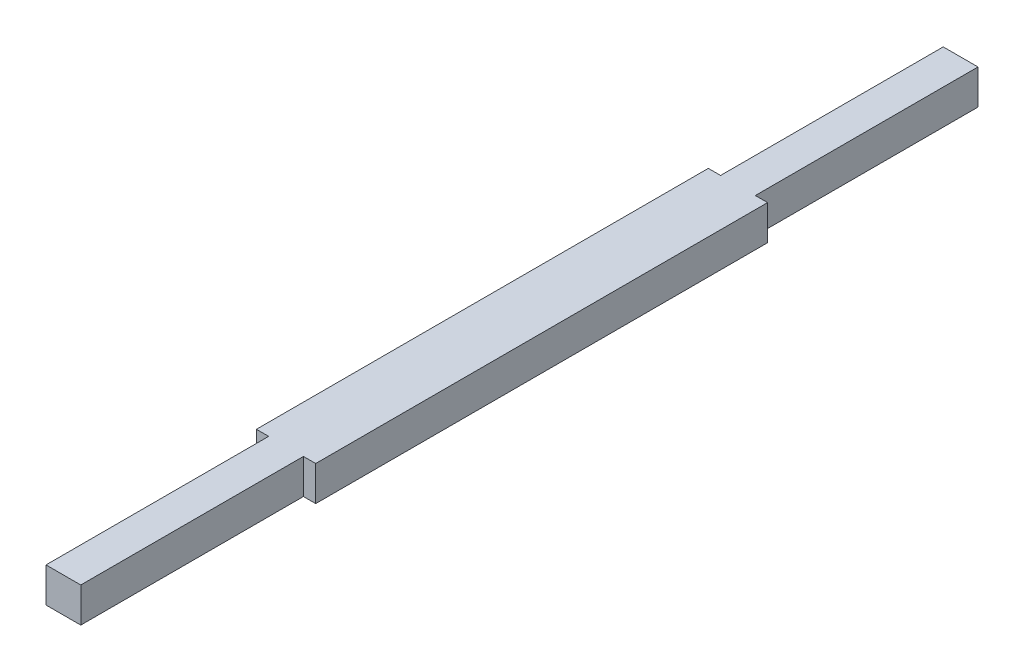
ISO-10303-21;
HEADER;
FILE_DESCRIPTION(('STEP AP214'),'2;1');
FILE_NAME('part.step','',(''),(''),'','','');
FILE_SCHEMA(('AUTOMOTIVE_DESIGN { 1 0 10303 214 1 1 1 1 }'));
ENDSEC;
DATA;
#1=APPLICATION_CONTEXT('core data for automotive mechanical design processes');
#2=APPLICATION_PROTOCOL_DEFINITION('international standard','automotive_design',2000,#1);
#3=PRODUCT_CONTEXT('',#1,'mechanical');
#4=PRODUCT('Part','Part','',(#3));
#5=PRODUCT_RELATED_PRODUCT_CATEGORY('part','',(#4));
#6=PRODUCT_DEFINITION_FORMATION('','',#4);
#7=PRODUCT_DEFINITION_CONTEXT('part definition',#1,'design');
#8=PRODUCT_DEFINITION('design','',#6,#7);
#9=PRODUCT_DEFINITION_SHAPE('','',#8);
#10=(LENGTH_UNIT() NAMED_UNIT(*) SI_UNIT(.MILLI.,.METRE.));
#11=(NAMED_UNIT(*) PLANE_ANGLE_UNIT() SI_UNIT($,.RADIAN.));
#12=(NAMED_UNIT(*) SI_UNIT($,.STERADIAN.) SOLID_ANGLE_UNIT());
#13=UNCERTAINTY_MEASURE_WITH_UNIT(LENGTH_MEASURE(1.E-05),#10,'distance_accuracy_value','');
#14=(GEOMETRIC_REPRESENTATION_CONTEXT(3) GLOBAL_UNCERTAINTY_ASSIGNED_CONTEXT((#13)) GLOBAL_UNIT_ASSIGNED_CONTEXT((#10,
#11,#12)) REPRESENTATION_CONTEXT('',''));
#15=CARTESIAN_POINT('',(0.,0.,0.));
#16=DIRECTION('',(0.,0.,1.));
#17=DIRECTION('',(1.,0.,0.));
#18=AXIS2_PLACEMENT_3D('',#15,#16,#17);
#19=CARTESIAN_POINT('',(-4.5,-4.5,116.15));
#20=DIRECTION('',(1.,0.,0.));
#21=DIRECTION('',(0.,0.,-1.));
#22=AXIS2_PLACEMENT_3D('',#19,#20,#21);
#23=PLANE('',#22);
#24=DIRECTION('',(0.,-1.,0.));
#25=VECTOR('',#24,1.);
#26=CARTESIAN_POINT('',(-4.5,4.5,-58.5));
#27=LINE('',#26,#25);
#28=CARTESIAN_POINT('',(-4.5,4.5,-58.5));
#29=VERTEX_POINT('',#28);
#30=CARTESIAN_POINT('',(-4.5,-4.5,-58.5));
#31=VERTEX_POINT('',#30);
#32=EDGE_CURVE('E223',#29,#31,#27,.T.);
#33=ORIENTED_EDGE('',*,*,#32,.F.);
#34=DIRECTION('',(0.,0.,-1.));
#35=VECTOR('',#34,1.);
#36=CARTESIAN_POINT('',(-4.5,4.5,116.15));
#37=LINE('',#36,#35);
#38=CARTESIAN_POINT('',(-4.5,4.5,-116.15));
#39=VERTEX_POINT('',#38);
#40=EDGE_CURVE('E210',#29,#39,#37,.T.);
#41=ORIENTED_EDGE('',*,*,#40,.T.);
#42=DIRECTION('',(0.,-1.,0.));
#43=VECTOR('',#42,1.);
#44=CARTESIAN_POINT('',(-4.5,-4.5,-116.15));
#45=LINE('',#44,#43);
#46=CARTESIAN_POINT('',(-4.5,-4.5,-116.15));
#47=VERTEX_POINT('',#46);
#48=EDGE_CURVE('E202',#39,#47,#45,.T.);
#49=ORIENTED_EDGE('',*,*,#48,.T.);
#50=DIRECTION('',(0.,0.,-1.));
#51=VECTOR('',#50,1.);
#52=CARTESIAN_POINT('',(-4.5,-4.5,116.15));
#53=LINE('',#52,#51);
#54=EDGE_CURVE('E209',#31,#47,#53,.T.);
#55=ORIENTED_EDGE('',*,*,#54,.F.);
#56=EDGE_LOOP('',(#33,#41,#49,#55));
#57=FACE_BOUND('',#56,.T.);
#58=ADVANCED_FACE('F41',(#57),#23,.F.);
#59=CARTESIAN_POINT('',(4.5,-4.5,116.15));
#60=DIRECTION('',(-1.,0.,0.));
#61=DIRECTION('',(0.,0.,1.));
#62=AXIS2_PLACEMENT_3D('',#59,#60,#61);
#63=PLANE('',#62);
#64=DIRECTION('',(0.,-1.,0.));
#65=VECTOR('',#64,1.);
#66=CARTESIAN_POINT('',(4.5,4.5,58.5));
#67=LINE('',#66,#65);
#68=CARTESIAN_POINT('',(4.5,4.5,58.5));
#69=VERTEX_POINT('',#68);
#70=CARTESIAN_POINT('',(4.5,-4.5,58.5));
#71=VERTEX_POINT('',#70);
#72=EDGE_CURVE('E182',#69,#71,#67,.T.);
#73=ORIENTED_EDGE('',*,*,#72,.F.);
#74=DIRECTION('',(0.,0.,-1.));
#75=VECTOR('',#74,1.);
#76=CARTESIAN_POINT('',(4.5,4.5,116.15));
#77=LINE('',#76,#75);
#78=CARTESIAN_POINT('',(4.5,4.5,116.15));
#79=VERTEX_POINT('',#78);
#80=EDGE_CURVE('E11',#79,#69,#77,.T.);
#81=ORIENTED_EDGE('',*,*,#80,.F.);
#82=DIRECTION('',(0.,1.,0.));
#83=VECTOR('',#82,1.);
#84=CARTESIAN_POINT('',(4.5,-4.5,116.15));
#85=LINE('',#84,#83);
#86=CARTESIAN_POINT('',(4.5,-4.5,116.15));
#87=VERTEX_POINT('',#86);
#88=EDGE_CURVE('E186',#87,#79,#85,.T.);
#89=ORIENTED_EDGE('',*,*,#88,.F.);
#90=DIRECTION('',(0.,0.,-1.));
#91=VECTOR('',#90,1.);
#92=CARTESIAN_POINT('',(4.5,-4.5,116.15));
#93=LINE('',#92,#91);
#94=EDGE_CURVE('E206',#87,#71,#93,.T.);
#95=ORIENTED_EDGE('',*,*,#94,.T.);
#96=EDGE_LOOP('',(#73,#81,#89,#95));
#97=FACE_BOUND('',#96,.T.);
#98=ADVANCED_FACE('F245',(#97),#63,.F.);
#99=CARTESIAN_POINT('',(4.5,4.5,-58.5));
#100=VERTEX_POINT('',#99);
#101=CARTESIAN_POINT('',(4.5,4.5,-116.15));
#102=VERTEX_POINT('',#101);
#103=EDGE_CURVE('E49',#100,#102,#77,.T.);
#104=ORIENTED_EDGE('',*,*,#103,.F.);
#105=DIRECTION('',(0.,-1.,0.));
#106=VECTOR('',#105,1.);
#107=CARTESIAN_POINT('',(4.5,4.5,-58.5));
#108=LINE('',#107,#106);
#109=CARTESIAN_POINT('',(4.5,-4.5,-58.5));
#110=VERTEX_POINT('',#109);
#111=EDGE_CURVE('E171',#100,#110,#108,.T.);
#112=ORIENTED_EDGE('',*,*,#111,.T.);
#113=CARTESIAN_POINT('',(4.5,-4.5,-116.15));
#114=VERTEX_POINT('',#113);
#115=EDGE_CURVE('E196',#110,#114,#93,.T.);
#116=ORIENTED_EDGE('',*,*,#115,.T.);
#117=DIRECTION('',(0.,1.,0.));
#118=VECTOR('',#117,1.);
#119=CARTESIAN_POINT('',(4.5,-4.5,-116.15));
#120=LINE('',#119,#118);
#121=EDGE_CURVE('E185',#114,#102,#120,.T.);
#122=ORIENTED_EDGE('',*,*,#121,.T.);
#123=EDGE_LOOP('',(#104,#112,#116,#122));
#124=FACE_BOUND('',#123,.T.);
#125=ADVANCED_FACE('F43',(#124),#63,.F.);
#126=CARTESIAN_POINT('',(-4.5,4.5,116.15));
#127=DIRECTION('',(0.,-1.,0.));
#128=DIRECTION('',(0.,0.,-1.));
#129=AXIS2_PLACEMENT_3D('',#126,#127,#128);
#130=PLANE('',#129);
#131=DIRECTION('',(-1.,0.,0.));
#132=VECTOR('',#131,1.);
#133=CARTESIAN_POINT('',(-4.5,4.5,-116.15));
#134=LINE('',#133,#132);
#135=EDGE_CURVE('E199',#102,#39,#134,.T.);
#136=ORIENTED_EDGE('',*,*,#135,.T.);
#137=ORIENTED_EDGE('',*,*,#40,.F.);
#138=DIRECTION('',(-1.,0.,0.));
#139=VECTOR('',#138,1.);
#140=CARTESIAN_POINT('',(-4.5,4.5,-58.5));
#141=LINE('',#140,#139);
#142=CARTESIAN_POINT('',(-7.675,4.5,-58.5));
#143=VERTEX_POINT('',#142);
#144=EDGE_CURVE('E155',#29,#143,#141,.T.);
#145=ORIENTED_EDGE('',*,*,#144,.T.);
#146=DIRECTION('',(0.,0.,1.));
#147=VECTOR('',#146,1.);
#148=CARTESIAN_POINT('',(-7.675,4.5,-58.5));
#149=LINE('',#148,#147);
#150=CARTESIAN_POINT('',(-7.675,4.5,58.5));
#151=VERTEX_POINT('',#150);
#152=EDGE_CURVE('E157',#143,#151,#149,.T.);
#153=ORIENTED_EDGE('',*,*,#152,.T.);
#154=DIRECTION('',(1.,0.,0.));
#155=VECTOR('',#154,1.);
#156=CARTESIAN_POINT('',(-4.5,4.5,58.5));
#157=LINE('',#156,#155);
#158=CARTESIAN_POINT('',(-4.5,4.5,58.5));
#159=VERTEX_POINT('',#158);
#160=EDGE_CURVE('E146',#151,#159,#157,.T.);
#161=ORIENTED_EDGE('',*,*,#160,.T.);
#162=CARTESIAN_POINT('',(-4.5,4.5,116.15));
#163=VERTEX_POINT('',#162);
#164=EDGE_CURVE('E211',#163,#159,#37,.T.);
#165=ORIENTED_EDGE('',*,*,#164,.F.);
#166=DIRECTION('',(-1.,0.,0.));
#167=VECTOR('',#166,1.);
#168=CARTESIAN_POINT('',(-4.5,4.5,116.15));
#169=LINE('',#168,#167);
#170=EDGE_CURVE('E189',#79,#163,#169,.T.);
#171=ORIENTED_EDGE('',*,*,#170,.F.);
#172=ORIENTED_EDGE('',*,*,#80,.T.);
#173=DIRECTION('',(1.,0.,0.));
#174=VECTOR('',#173,1.);
#175=CARTESIAN_POINT('',(4.5,4.5,58.5));
#176=LINE('',#175,#174);
#177=CARTESIAN_POINT('',(7.675,4.5,58.5));
#178=VERTEX_POINT('',#177);
#179=EDGE_CURVE('E165',#69,#178,#176,.T.);
#180=ORIENTED_EDGE('',*,*,#179,.T.);
#181=DIRECTION('',(0.,0.,-1.));
#182=VECTOR('',#181,1.);
#183=CARTESIAN_POINT('',(7.675,4.5,-58.5));
#184=LINE('',#183,#182);
#185=CARTESIAN_POINT('',(7.675,4.5,-58.5));
#186=VERTEX_POINT('',#185);
#187=EDGE_CURVE('E167',#178,#186,#184,.T.);
#188=ORIENTED_EDGE('',*,*,#187,.T.);
#189=DIRECTION('',(-1.,0.,0.));
#190=VECTOR('',#189,1.);
#191=CARTESIAN_POINT('',(4.5,4.5,-58.5));
#192=LINE('',#191,#190);
#193=EDGE_CURVE('E169',#186,#100,#192,.T.);
#194=ORIENTED_EDGE('',*,*,#193,.T.);
#195=ORIENTED_EDGE('',*,*,#103,.T.);
#196=EDGE_LOOP('',(#136,#137,#145,#153,#161,#165,#171,#172,#180,#188,#194,#195));
#197=FACE_BOUND('',#196,.T.);
#198=ADVANCED_FACE('F226',(#197),#130,.F.);
#199=ORIENTED_EDGE('',*,*,#164,.T.);
#200=DIRECTION('',(0.,-1.,0.));
#201=VECTOR('',#200,1.);
#202=CARTESIAN_POINT('',(-4.5,4.5,58.5));
#203=LINE('',#202,#201);
#204=CARTESIAN_POINT('',(-4.5,-4.5,58.5));
#205=VERTEX_POINT('',#204);
#206=EDGE_CURVE('E147',#159,#205,#203,.T.);
#207=ORIENTED_EDGE('',*,*,#206,.T.);
#208=CARTESIAN_POINT('',(-4.5,-4.5,116.15));
#209=VERTEX_POINT('',#208);
#210=EDGE_CURVE('E154',#209,#205,#53,.T.);
#211=ORIENTED_EDGE('',*,*,#210,.F.);
#212=DIRECTION('',(0.,-1.,0.));
#213=VECTOR('',#212,1.);
#214=CARTESIAN_POINT('',(-4.5,-4.5,116.15));
#215=LINE('',#214,#213);
#216=EDGE_CURVE('E192',#163,#209,#215,.T.);
#217=ORIENTED_EDGE('',*,*,#216,.F.);
#218=EDGE_LOOP('',(#199,#207,#211,#217));
#219=FACE_BOUND('',#218,.T.);
#220=ADVANCED_FACE('F236',(#219),#23,.F.);
#221=CARTESIAN_POINT('',(-4.5,-4.5,116.15));
#222=DIRECTION('',(0.,1.,0.));
#223=DIRECTION('',(0.,0.,1.));
#224=AXIS2_PLACEMENT_3D('',#221,#222,#223);
#225=PLANE('',#224);
#226=DIRECTION('',(1.,0.,0.));
#227=VECTOR('',#226,1.);
#228=CARTESIAN_POINT('',(-4.5,-4.5,-116.15));
#229=LINE('',#228,#227);
#230=EDGE_CURVE('E190',#47,#114,#229,.T.);
#231=ORIENTED_EDGE('',*,*,#230,.T.);
#232=ORIENTED_EDGE('',*,*,#115,.F.);
#233=DIRECTION('',(-1.,0.,0.));
#234=VECTOR('',#233,1.);
#235=CARTESIAN_POINT('',(4.5,-4.5,-58.5));
#236=LINE('',#235,#234);
#237=CARTESIAN_POINT('',(7.675,-4.5,-58.5));
#238=VERTEX_POINT('',#237);
#239=EDGE_CURVE('E64',#238,#110,#236,.T.);
#240=ORIENTED_EDGE('',*,*,#239,.F.);
#241=DIRECTION('',(0.,0.,-1.));
#242=VECTOR('',#241,1.);
#243=CARTESIAN_POINT('',(7.675,-4.5,-58.5));
#244=LINE('',#243,#242);
#245=CARTESIAN_POINT('',(7.675,-4.5,58.5));
#246=VERTEX_POINT('',#245);
#247=EDGE_CURVE('E173',#246,#238,#244,.T.);
#248=ORIENTED_EDGE('',*,*,#247,.F.);
#249=DIRECTION('',(1.,0.,0.));
#250=VECTOR('',#249,1.);
#251=CARTESIAN_POINT('',(4.5,-4.5,58.5));
#252=LINE('',#251,#250);
#253=EDGE_CURVE('E162',#71,#246,#252,.T.);
#254=ORIENTED_EDGE('',*,*,#253,.F.);
#255=ORIENTED_EDGE('',*,*,#94,.F.);
#256=DIRECTION('',(1.,0.,0.));
#257=VECTOR('',#256,1.);
#258=CARTESIAN_POINT('',(-4.5,-4.5,116.15));
#259=LINE('',#258,#257);
#260=EDGE_CURVE('E194',#209,#87,#259,.T.);
#261=ORIENTED_EDGE('',*,*,#260,.F.);
#262=ORIENTED_EDGE('',*,*,#210,.T.);
#263=DIRECTION('',(1.,0.,0.));
#264=VECTOR('',#263,1.);
#265=CARTESIAN_POINT('',(-4.5,-4.5,58.5));
#266=LINE('',#265,#264);
#267=CARTESIAN_POINT('',(-7.675,-4.5,58.5));
#268=VERTEX_POINT('',#267);
#269=EDGE_CURVE('E56',#268,#205,#266,.T.);
#270=ORIENTED_EDGE('',*,*,#269,.F.);
#271=DIRECTION('',(0.,0.,1.));
#272=VECTOR('',#271,1.);
#273=CARTESIAN_POINT('',(-7.675,-4.5,-58.5));
#274=LINE('',#273,#272);
#275=CARTESIAN_POINT('',(-7.675,-4.5,-58.5));
#276=VERTEX_POINT('',#275);
#277=EDGE_CURVE('E135',#276,#268,#274,.T.);
#278=ORIENTED_EDGE('',*,*,#277,.F.);
#279=DIRECTION('',(-1.,0.,0.));
#280=VECTOR('',#279,1.);
#281=CARTESIAN_POINT('',(-4.5,-4.5,-58.5));
#282=LINE('',#281,#280);
#283=EDGE_CURVE('E143',#31,#276,#282,.T.);
#284=ORIENTED_EDGE('',*,*,#283,.F.);
#285=ORIENTED_EDGE('',*,*,#54,.T.);
#286=EDGE_LOOP('',(#231,#232,#240,#248,#254,#255,#261,#262,#270,#278,#284,#285));
#287=FACE_BOUND('',#286,.T.);
#288=ADVANCED_FACE('F151',(#287),#225,.F.);
#289=CARTESIAN_POINT('',(0.,0.,116.15));
#290=DIRECTION('',(0.,0.,-1.));
#291=DIRECTION('',(-1.,0.,0.));
#292=AXIS2_PLACEMENT_3D('',#289,#290,#291);
#293=PLANE('',#292);
#294=ORIENTED_EDGE('',*,*,#88,.T.);
#295=ORIENTED_EDGE('',*,*,#170,.T.);
#296=ORIENTED_EDGE('',*,*,#216,.T.);
#297=ORIENTED_EDGE('',*,*,#260,.T.);
#298=EDGE_LOOP('',(#294,#295,#296,#297));
#299=FACE_BOUND('',#298,.T.);
#300=ADVANCED_FACE('F240',(#299),#293,.F.);
#301=CARTESIAN_POINT('',(0.,0.,-116.15));
#302=DIRECTION('',(0.,0.,-1.));
#303=DIRECTION('',(-1.,0.,0.));
#304=AXIS2_PLACEMENT_3D('',#301,#302,#303);
#305=PLANE('',#304);
#306=ORIENTED_EDGE('',*,*,#121,.F.);
#307=ORIENTED_EDGE('',*,*,#230,.F.);
#308=ORIENTED_EDGE('',*,*,#48,.F.);
#309=ORIENTED_EDGE('',*,*,#135,.F.);
#310=EDGE_LOOP('',(#306,#307,#308,#309));
#311=FACE_BOUND('',#310,.T.);
#312=ADVANCED_FACE('F230',(#311),#305,.T.);
#313=CARTESIAN_POINT('',(4.5,4.5,58.5));
#314=DIRECTION('',(0.,0.,-1.));
#315=DIRECTION('',(-1.,0.,0.));
#316=AXIS2_PLACEMENT_3D('',#313,#314,#315);
#317=PLANE('',#316);
#318=ORIENTED_EDGE('',*,*,#253,.T.);
#319=DIRECTION('',(0.,-1.,0.));
#320=VECTOR('',#319,1.);
#321=CARTESIAN_POINT('',(7.675,4.5,58.5));
#322=LINE('',#321,#320);
#323=EDGE_CURVE('E179',#178,#246,#322,.T.);
#324=ORIENTED_EDGE('',*,*,#323,.F.);
#325=ORIENTED_EDGE('',*,*,#179,.F.);
#326=ORIENTED_EDGE('',*,*,#72,.T.);
#327=EDGE_LOOP('',(#318,#324,#325,#326));
#328=FACE_BOUND('',#327,.T.);
#329=ADVANCED_FACE('F247',(#328),#317,.F.);
#330=CARTESIAN_POINT('',(7.675,4.5,-58.5));
#331=DIRECTION('',(-1.,0.,0.));
#332=DIRECTION('',(0.,0.,1.));
#333=AXIS2_PLACEMENT_3D('',#330,#331,#332);
#334=PLANE('',#333);
#335=ORIENTED_EDGE('',*,*,#247,.T.);
#336=DIRECTION('',(0.,-1.,0.));
#337=VECTOR('',#336,1.);
#338=CARTESIAN_POINT('',(7.675,4.5,-58.5));
#339=LINE('',#338,#337);
#340=EDGE_CURVE('E177',#186,#238,#339,.T.);
#341=ORIENTED_EDGE('',*,*,#340,.F.);
#342=ORIENTED_EDGE('',*,*,#187,.F.);
#343=ORIENTED_EDGE('',*,*,#323,.T.);
#344=EDGE_LOOP('',(#335,#341,#342,#343));
#345=FACE_BOUND('',#344,.T.);
#346=ADVANCED_FACE('F252',(#345),#334,.F.);
#347=CARTESIAN_POINT('',(4.5,4.5,-58.5));
#348=DIRECTION('',(0.,0.,1.));
#349=DIRECTION('',(1.,0.,0.));
#350=AXIS2_PLACEMENT_3D('',#347,#348,#349);
#351=PLANE('',#350);
#352=ORIENTED_EDGE('',*,*,#239,.T.);
#353=ORIENTED_EDGE('',*,*,#111,.F.);
#354=ORIENTED_EDGE('',*,*,#193,.F.);
#355=ORIENTED_EDGE('',*,*,#340,.T.);
#356=EDGE_LOOP('',(#352,#353,#354,#355));
#357=FACE_BOUND('',#356,.T.);
#358=ADVANCED_FACE('F254',(#357),#351,.F.);
#359=CARTESIAN_POINT('',(-4.5,4.5,-58.5));
#360=DIRECTION('',(0.,0.,1.));
#361=DIRECTION('',(1.,0.,0.));
#362=AXIS2_PLACEMENT_3D('',#359,#360,#361);
#363=PLANE('',#362);
#364=ORIENTED_EDGE('',*,*,#283,.T.);
#365=DIRECTION('',(0.,-1.,0.));
#366=VECTOR('',#365,1.);
#367=CARTESIAN_POINT('',(-7.675,4.5,-58.5));
#368=LINE('',#367,#366);
#369=EDGE_CURVE('E141',#143,#276,#368,.T.);
#370=ORIENTED_EDGE('',*,*,#369,.F.);
#371=ORIENTED_EDGE('',*,*,#144,.F.);
#372=ORIENTED_EDGE('',*,*,#32,.T.);
#373=EDGE_LOOP('',(#364,#370,#371,#372));
#374=FACE_BOUND('',#373,.T.);
#375=ADVANCED_FACE('F233',(#374),#363,.F.);
#376=CARTESIAN_POINT('',(-7.675,4.5,-58.5));
#377=DIRECTION('',(1.,0.,0.));
#378=DIRECTION('',(0.,0.,-1.));
#379=AXIS2_PLACEMENT_3D('',#376,#377,#378);
#380=PLANE('',#379);
#381=ORIENTED_EDGE('',*,*,#277,.T.);
#382=DIRECTION('',(0.,-1.,0.));
#383=VECTOR('',#382,1.);
#384=CARTESIAN_POINT('',(-7.675,4.5,58.5));
#385=LINE('',#384,#383);
#386=EDGE_CURVE('E138',#151,#268,#385,.T.);
#387=ORIENTED_EDGE('',*,*,#386,.F.);
#388=ORIENTED_EDGE('',*,*,#152,.F.);
#389=ORIENTED_EDGE('',*,*,#369,.T.);
#390=EDGE_LOOP('',(#381,#387,#388,#389));
#391=FACE_BOUND('',#390,.T.);
#392=ADVANCED_FACE('F136',(#391),#380,.F.);
#393=CARTESIAN_POINT('',(-4.5,4.5,58.5));
#394=DIRECTION('',(0.,0.,-1.));
#395=DIRECTION('',(-1.,0.,0.));
#396=AXIS2_PLACEMENT_3D('',#393,#394,#395);
#397=PLANE('',#396);
#398=ORIENTED_EDGE('',*,*,#269,.T.);
#399=ORIENTED_EDGE('',*,*,#206,.F.);
#400=ORIENTED_EDGE('',*,*,#160,.F.);
#401=ORIENTED_EDGE('',*,*,#386,.T.);
#402=EDGE_LOOP('',(#398,#399,#400,#401));
#403=FACE_BOUND('',#402,.T.);
#404=ADVANCED_FACE('F145',(#403),#397,.F.);
#405=CLOSED_SHELL('',(#58,#98,#125,#198,#220,#288,#300,#312,#329,#346,#358,#375,#392,#404));
#406=MANIFOLD_SOLID_BREP('B2',#405);
#407=ADVANCED_BREP_SHAPE_REPRESENTATION('',(#18,#406),#14);
#408=SHAPE_DEFINITION_REPRESENTATION(#9,#407);
ENDSEC;
END-ISO-10303-21;
